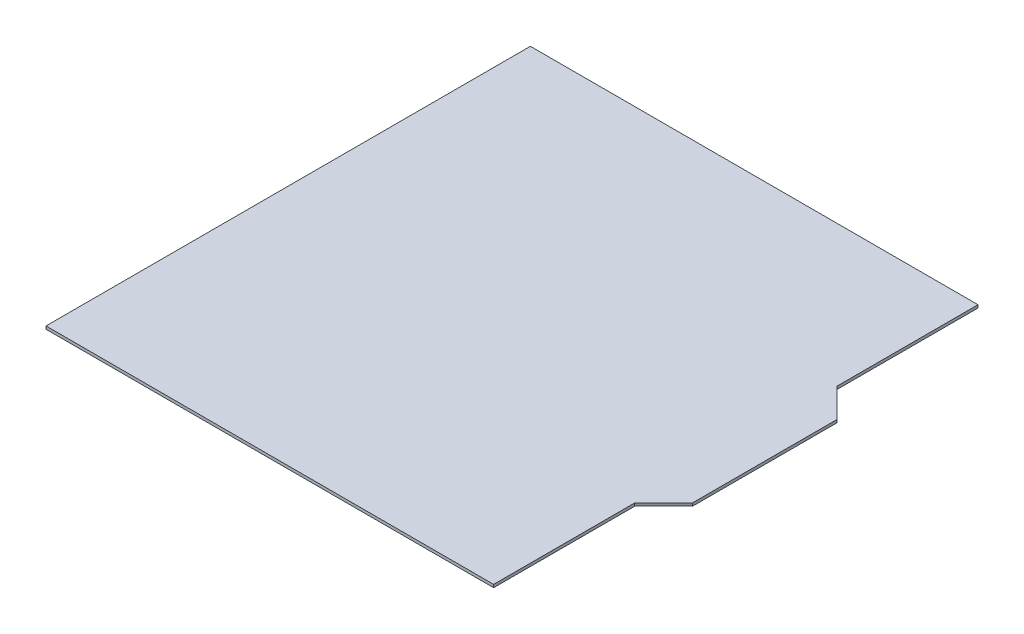
ISO-10303-21;
HEADER;
FILE_DESCRIPTION(('STEP AP214'),'2;1');
FILE_NAME('part.step','',(''),(''),'','','');
FILE_SCHEMA(('AUTOMOTIVE_DESIGN { 1 0 10303 214 1 1 1 1 }'));
ENDSEC;
DATA;
#1=APPLICATION_CONTEXT('core data for automotive mechanical design processes');
#2=APPLICATION_PROTOCOL_DEFINITION('international standard','automotive_design',2000,#1);
#3=PRODUCT_CONTEXT('',#1,'mechanical');
#4=PRODUCT('Part','Part','',(#3));
#5=PRODUCT_RELATED_PRODUCT_CATEGORY('part','',(#4));
#6=PRODUCT_DEFINITION_FORMATION('','',#4);
#7=PRODUCT_DEFINITION_CONTEXT('part definition',#1,'design');
#8=PRODUCT_DEFINITION('design','',#6,#7);
#9=PRODUCT_DEFINITION_SHAPE('','',#8);
#10=(LENGTH_UNIT() NAMED_UNIT(*) SI_UNIT(.MILLI.,.METRE.));
#11=(NAMED_UNIT(*) PLANE_ANGLE_UNIT() SI_UNIT($,.RADIAN.));
#12=(NAMED_UNIT(*) SI_UNIT($,.STERADIAN.) SOLID_ANGLE_UNIT());
#13=UNCERTAINTY_MEASURE_WITH_UNIT(LENGTH_MEASURE(1.E-05),#10,'distance_accuracy_value','');
#14=(GEOMETRIC_REPRESENTATION_CONTEXT(3) GLOBAL_UNCERTAINTY_ASSIGNED_CONTEXT((#13)) GLOBAL_UNIT_ASSIGNED_CONTEXT((#10,
#11,#12)) REPRESENTATION_CONTEXT('',''));
#15=CARTESIAN_POINT('',(0.,0.,0.));
#16=DIRECTION('',(0.,0.,1.));
#17=DIRECTION('',(1.,0.,0.));
#18=AXIS2_PLACEMENT_3D('',#15,#16,#17);
#19=CARTESIAN_POINT('',(155.,-2.,-70.));
#20=DIRECTION('',(1.,0.,0.));
#21=DIRECTION('',(0.,0.,-1.));
#22=AXIS2_PLACEMENT_3D('',#19,#20,#21);
#23=PLANE('',#22);
#24=DIRECTION('',(0.,0.,-1.));
#25=VECTOR('',#24,1.);
#26=CARTESIAN_POINT('',(155.,0.,-70.));
#27=LINE('',#26,#25);
#28=CARTESIAN_POINT('',(155.,0.,-70.));
#29=VERTEX_POINT('',#28);
#30=CARTESIAN_POINT('',(155.,0.,-167.726093983031));
#31=VERTEX_POINT('',#30);
#32=EDGE_CURVE('E139',#29,#31,#27,.T.);
#33=ORIENTED_EDGE('',*,*,#32,.F.);
#34=DIRECTION('',(0.,1.,0.));
#35=VECTOR('',#34,1.);
#36=CARTESIAN_POINT('',(155.,-2.,-70.));
#37=LINE('',#36,#35);
#38=CARTESIAN_POINT('',(155.,-2.,-70.));
#39=VERTEX_POINT('',#38);
#40=EDGE_CURVE('E11',#39,#29,#37,.T.);
#41=ORIENTED_EDGE('',*,*,#40,.F.);
#42=DIRECTION('',(0.,0.,-1.));
#43=VECTOR('',#42,1.);
#44=CARTESIAN_POINT('',(155.,-2.,-70.));
#45=LINE('',#44,#43);
#46=CARTESIAN_POINT('',(155.,-2.,-167.726093983031));
#47=VERTEX_POINT('',#46);
#48=EDGE_CURVE('E159',#39,#47,#45,.T.);
#49=ORIENTED_EDGE('',*,*,#48,.T.);
#50=DIRECTION('',(0.,1.,0.));
#51=VECTOR('',#50,1.);
#52=CARTESIAN_POINT('',(155.,-2.,-167.726093983031));
#53=LINE('',#52,#51);
#54=EDGE_CURVE('E45',#47,#31,#53,.T.);
#55=ORIENTED_EDGE('',*,*,#54,.T.);
#56=EDGE_LOOP('',(#33,#41,#49,#55));
#57=FACE_BOUND('',#56,.T.);
#58=ADVANCED_FACE('F42',(#57),#23,.T.);
#59=CARTESIAN_POINT('',(175.,-2.,-50.));
#60=DIRECTION('',(0.707106781186548,0.,-0.707106781186547));
#61=DIRECTION('',(-0.707106781186547,0.,-0.707106781186548));
#62=AXIS2_PLACEMENT_3D('',#59,#60,#61);
#63=PLANE('',#62);
#64=DIRECTION('',(-0.707106781186547,0.,-0.707106781186548));
#65=VECTOR('',#64,1.);
#66=CARTESIAN_POINT('',(175.,0.,-50.));
#67=LINE('',#66,#65);
#68=CARTESIAN_POINT('',(175.,0.,-50.));
#69=VERTEX_POINT('',#68);
#70=EDGE_CURVE('E157',#69,#29,#67,.T.);
#71=ORIENTED_EDGE('',*,*,#70,.F.);
#72=DIRECTION('',(0.,1.,0.));
#73=VECTOR('',#72,1.);
#74=CARTESIAN_POINT('',(175.,-2.,-50.));
#75=LINE('',#74,#73);
#76=CARTESIAN_POINT('',(175.,-2.,-50.));
#77=VERTEX_POINT('',#76);
#78=EDGE_CURVE('E51',#77,#69,#75,.T.);
#79=ORIENTED_EDGE('',*,*,#78,.F.);
#80=DIRECTION('',(-0.707106781186547,0.,-0.707106781186548));
#81=VECTOR('',#80,1.);
#82=CARTESIAN_POINT('',(175.,-2.,-50.));
#83=LINE('',#82,#81);
#84=EDGE_CURVE('E129',#77,#39,#83,.T.);
#85=ORIENTED_EDGE('',*,*,#84,.T.);
#86=ORIENTED_EDGE('',*,*,#40,.T.);
#87=EDGE_LOOP('',(#71,#79,#85,#86));
#88=FACE_BOUND('',#87,.T.);
#89=ADVANCED_FACE('F171',(#88),#63,.T.);
#90=CARTESIAN_POINT('',(175.,-2.,-50.));
#91=DIRECTION('',(1.,0.,0.));
#92=DIRECTION('',(0.,0.,-1.));
#93=AXIS2_PLACEMENT_3D('',#90,#91,#92);
#94=PLANE('',#93);
#95=DIRECTION('',(0.,0.,-1.));
#96=VECTOR('',#95,1.);
#97=CARTESIAN_POINT('',(175.,0.,-50.));
#98=LINE('',#97,#96);
#99=CARTESIAN_POINT('',(175.,0.,50.));
#100=VERTEX_POINT('',#99);
#101=EDGE_CURVE('E116',#100,#69,#98,.T.);
#102=ORIENTED_EDGE('',*,*,#101,.F.);
#103=DIRECTION('',(0.,1.,0.));
#104=VECTOR('',#103,1.);
#105=CARTESIAN_POINT('',(175.,-2.,50.));
#106=LINE('',#105,#104);
#107=CARTESIAN_POINT('',(175.,-2.,50.));
#108=VERTEX_POINT('',#107);
#109=EDGE_CURVE('E111',#108,#100,#106,.T.);
#110=ORIENTED_EDGE('',*,*,#109,.F.);
#111=DIRECTION('',(0.,0.,-1.));
#112=VECTOR('',#111,1.);
#113=CARTESIAN_POINT('',(175.,-2.,-50.));
#114=LINE('',#113,#112);
#115=EDGE_CURVE('E114',#108,#77,#114,.T.);
#116=ORIENTED_EDGE('',*,*,#115,.T.);
#117=ORIENTED_EDGE('',*,*,#78,.T.);
#118=EDGE_LOOP('',(#102,#110,#116,#117));
#119=FACE_BOUND('',#118,.T.);
#120=ADVANCED_FACE('F113',(#119),#94,.T.);
#121=CARTESIAN_POINT('',(175.,-2.,50.));
#122=DIRECTION('',(0.707106781186548,0.,0.707106781186547));
#123=DIRECTION('',(0.707106781186547,0.,-0.707106781186548));
#124=AXIS2_PLACEMENT_3D('',#121,#122,#123);
#125=PLANE('',#124);
#126=DIRECTION('',(0.707106781186547,0.,-0.707106781186548));
#127=VECTOR('',#126,1.);
#128=CARTESIAN_POINT('',(175.,0.,50.));
#129=LINE('',#128,#127);
#130=CARTESIAN_POINT('',(155.,0.,70.));
#131=VERTEX_POINT('',#130);
#132=EDGE_CURVE('E154',#131,#100,#129,.T.);
#133=ORIENTED_EDGE('',*,*,#132,.F.);
#134=DIRECTION('',(0.,1.,0.));
#135=VECTOR('',#134,1.);
#136=CARTESIAN_POINT('',(155.,-2.,70.));
#137=LINE('',#136,#135);
#138=CARTESIAN_POINT('',(155.,-2.,70.));
#139=VERTEX_POINT('',#138);
#140=EDGE_CURVE('E121',#139,#131,#137,.T.);
#141=ORIENTED_EDGE('',*,*,#140,.F.);
#142=DIRECTION('',(0.707106781186547,0.,-0.707106781186548));
#143=VECTOR('',#142,1.);
#144=CARTESIAN_POINT('',(175.,-2.,50.));
#145=LINE('',#144,#143);
#146=EDGE_CURVE('E127',#139,#108,#145,.T.);
#147=ORIENTED_EDGE('',*,*,#146,.T.);
#148=ORIENTED_EDGE('',*,*,#109,.T.);
#149=EDGE_LOOP('',(#133,#141,#147,#148));
#150=FACE_BOUND('',#149,.T.);
#151=ADVANCED_FACE('F131',(#150),#125,.T.);
#152=CARTESIAN_POINT('',(155.,-2.,167.726093983031));
#153=DIRECTION('',(1.,0.,0.));
#154=DIRECTION('',(0.,0.,-1.));
#155=AXIS2_PLACEMENT_3D('',#152,#153,#154);
#156=PLANE('',#155);
#157=DIRECTION('',(0.,0.,-1.));
#158=VECTOR('',#157,1.);
#159=CARTESIAN_POINT('',(155.,0.,167.726093983031));
#160=LINE('',#159,#158);
#161=CARTESIAN_POINT('',(155.,0.,167.726093983031));
#162=VERTEX_POINT('',#161);
#163=EDGE_CURVE('E151',#162,#131,#160,.T.);
#164=ORIENTED_EDGE('',*,*,#163,.F.);
#165=DIRECTION('',(0.,1.,0.));
#166=VECTOR('',#165,1.);
#167=CARTESIAN_POINT('',(155.,-2.,167.726093983031));
#168=LINE('',#167,#166);
#169=CARTESIAN_POINT('',(155.,-2.,167.726093983031));
#170=VERTEX_POINT('',#169);
#171=EDGE_CURVE('E163',#170,#162,#168,.T.);
#172=ORIENTED_EDGE('',*,*,#171,.F.);
#173=DIRECTION('',(0.,0.,-1.));
#174=VECTOR('',#173,1.);
#175=CARTESIAN_POINT('',(155.,-2.,167.726093983031));
#176=LINE('',#175,#174);
#177=EDGE_CURVE('E132',#170,#139,#176,.T.);
#178=ORIENTED_EDGE('',*,*,#177,.T.);
#179=ORIENTED_EDGE('',*,*,#140,.T.);
#180=EDGE_LOOP('',(#164,#172,#178,#179));
#181=FACE_BOUND('',#180,.T.);
#182=ADVANCED_FACE('F184',(#181),#156,.T.);
#183=CARTESIAN_POINT('',(-155.,-2.,167.726093983031));
#184=DIRECTION('',(0.,0.,1.));
#185=DIRECTION('',(1.,0.,0.));
#186=AXIS2_PLACEMENT_3D('',#183,#184,#185);
#187=PLANE('',#186);
#188=DIRECTION('',(1.,0.,0.));
#189=VECTOR('',#188,1.);
#190=CARTESIAN_POINT('',(-155.,0.,167.726093983031));
#191=LINE('',#190,#189);
#192=CARTESIAN_POINT('',(-155.,0.,167.726093983031));
#193=VERTEX_POINT('',#192);
#194=EDGE_CURVE('E148',#193,#162,#191,.T.);
#195=ORIENTED_EDGE('',*,*,#194,.F.);
#196=DIRECTION('',(0.,1.,0.));
#197=VECTOR('',#196,1.);
#198=CARTESIAN_POINT('',(-155.,-2.,167.726093983031));
#199=LINE('',#198,#197);
#200=CARTESIAN_POINT('',(-155.,-2.,167.726093983031));
#201=VERTEX_POINT('',#200);
#202=EDGE_CURVE('E165',#201,#193,#199,.T.);
#203=ORIENTED_EDGE('',*,*,#202,.F.);
#204=DIRECTION('',(1.,0.,0.));
#205=VECTOR('',#204,1.);
#206=CARTESIAN_POINT('',(-155.,-2.,167.726093983031));
#207=LINE('',#206,#205);
#208=EDGE_CURVE('E134',#201,#170,#207,.T.);
#209=ORIENTED_EDGE('',*,*,#208,.T.);
#210=ORIENTED_EDGE('',*,*,#171,.T.);
#211=EDGE_LOOP('',(#195,#203,#209,#210));
#212=FACE_BOUND('',#211,.T.);
#213=ADVANCED_FACE('F187',(#212),#187,.T.);
#214=CARTESIAN_POINT('',(-155.,-2.,167.726093983031));
#215=DIRECTION('',(-1.,0.,0.));
#216=DIRECTION('',(0.,0.,1.));
#217=AXIS2_PLACEMENT_3D('',#214,#215,#216);
#218=PLANE('',#217);
#219=DIRECTION('',(0.,0.,1.));
#220=VECTOR('',#219,1.);
#221=CARTESIAN_POINT('',(-155.,0.,167.726093983031));
#222=LINE('',#221,#220);
#223=CARTESIAN_POINT('',(-155.,0.,-167.726093983031));
#224=VERTEX_POINT('',#223);
#225=EDGE_CURVE('E145',#224,#193,#222,.T.);
#226=ORIENTED_EDGE('',*,*,#225,.F.);
#227=DIRECTION('',(0.,1.,0.));
#228=VECTOR('',#227,1.);
#229=CARTESIAN_POINT('',(-155.,-2.,-167.726093983031));
#230=LINE('',#229,#228);
#231=CARTESIAN_POINT('',(-155.,-2.,-167.726093983031));
#232=VERTEX_POINT('',#231);
#233=EDGE_CURVE('E166',#232,#224,#230,.T.);
#234=ORIENTED_EDGE('',*,*,#233,.F.);
#235=DIRECTION('',(0.,0.,1.));
#236=VECTOR('',#235,1.);
#237=CARTESIAN_POINT('',(-155.,-2.,167.726093983031));
#238=LINE('',#237,#236);
#239=EDGE_CURVE('E282',#232,#201,#238,.T.);
#240=ORIENTED_EDGE('',*,*,#239,.T.);
#241=ORIENTED_EDGE('',*,*,#202,.T.);
#242=EDGE_LOOP('',(#226,#234,#240,#241));
#243=FACE_BOUND('',#242,.T.);
#244=ADVANCED_FACE('F191',(#243),#218,.T.);
#245=CARTESIAN_POINT('',(-155.,-2.,-167.726093983031));
#246=DIRECTION('',(0.,0.,-1.));
#247=DIRECTION('',(-1.,0.,0.));
#248=AXIS2_PLACEMENT_3D('',#245,#246,#247);
#249=PLANE('',#248);
#250=DIRECTION('',(-1.,0.,0.));
#251=VECTOR('',#250,1.);
#252=CARTESIAN_POINT('',(-155.,0.,-167.726093983031));
#253=LINE('',#252,#251);
#254=EDGE_CURVE('E142',#31,#224,#253,.T.);
#255=ORIENTED_EDGE('',*,*,#254,.F.);
#256=ORIENTED_EDGE('',*,*,#54,.F.);
#257=DIRECTION('',(-1.,0.,0.));
#258=VECTOR('',#257,1.);
#259=CARTESIAN_POINT('',(-155.,-2.,-167.726093983031));
#260=LINE('',#259,#258);
#261=EDGE_CURVE('E283',#47,#232,#260,.T.);
#262=ORIENTED_EDGE('',*,*,#261,.T.);
#263=ORIENTED_EDGE('',*,*,#233,.T.);
#264=EDGE_LOOP('',(#255,#256,#262,#263));
#265=FACE_BOUND('',#264,.T.);
#266=ADVANCED_FACE('F168',(#265),#249,.T.);
#267=CARTESIAN_POINT('',(0.,-2.,0.));
#268=DIRECTION('',(0.,-1.,0.));
#269=DIRECTION('',(0.,0.,-1.));
#270=AXIS2_PLACEMENT_3D('',#267,#268,#269);
#271=PLANE('',#270);
#272=ORIENTED_EDGE('',*,*,#48,.F.);
#273=ORIENTED_EDGE('',*,*,#84,.F.);
#274=ORIENTED_EDGE('',*,*,#115,.F.);
#275=ORIENTED_EDGE('',*,*,#146,.F.);
#276=ORIENTED_EDGE('',*,*,#177,.F.);
#277=ORIENTED_EDGE('',*,*,#208,.F.);
#278=ORIENTED_EDGE('',*,*,#239,.F.);
#279=ORIENTED_EDGE('',*,*,#261,.F.);
#280=EDGE_LOOP('',(#272,#273,#274,#275,#276,#277,#278,#279));
#281=FACE_BOUND('',#280,.T.);
#282=ADVANCED_FACE('F125',(#281),#271,.T.);
#283=CARTESIAN_POINT('',(0.,0.,0.));
#284=DIRECTION('',(0.,-1.,0.));
#285=DIRECTION('',(0.,0.,-1.));
#286=AXIS2_PLACEMENT_3D('',#283,#284,#285);
#287=PLANE('',#286);
#288=ORIENTED_EDGE('',*,*,#32,.T.);
#289=ORIENTED_EDGE('',*,*,#254,.T.);
#290=ORIENTED_EDGE('',*,*,#225,.T.);
#291=ORIENTED_EDGE('',*,*,#194,.T.);
#292=ORIENTED_EDGE('',*,*,#163,.T.);
#293=ORIENTED_EDGE('',*,*,#132,.T.);
#294=ORIENTED_EDGE('',*,*,#101,.T.);
#295=ORIENTED_EDGE('',*,*,#70,.T.);
#296=EDGE_LOOP('',(#288,#289,#290,#291,#292,#293,#294,#295));
#297=FACE_BOUND('',#296,.T.);
#298=ADVANCED_FACE('F170',(#297),#287,.F.);
#299=CLOSED_SHELL('',(#58,#89,#120,#151,#182,#213,#244,#266,#282,#298));
#300=MANIFOLD_SOLID_BREP('B2',#299);
#301=ADVANCED_BREP_SHAPE_REPRESENTATION('',(#18,#300),#14);
#302=SHAPE_DEFINITION_REPRESENTATION(#9,#301);
ENDSEC;
END-ISO-10303-21;
